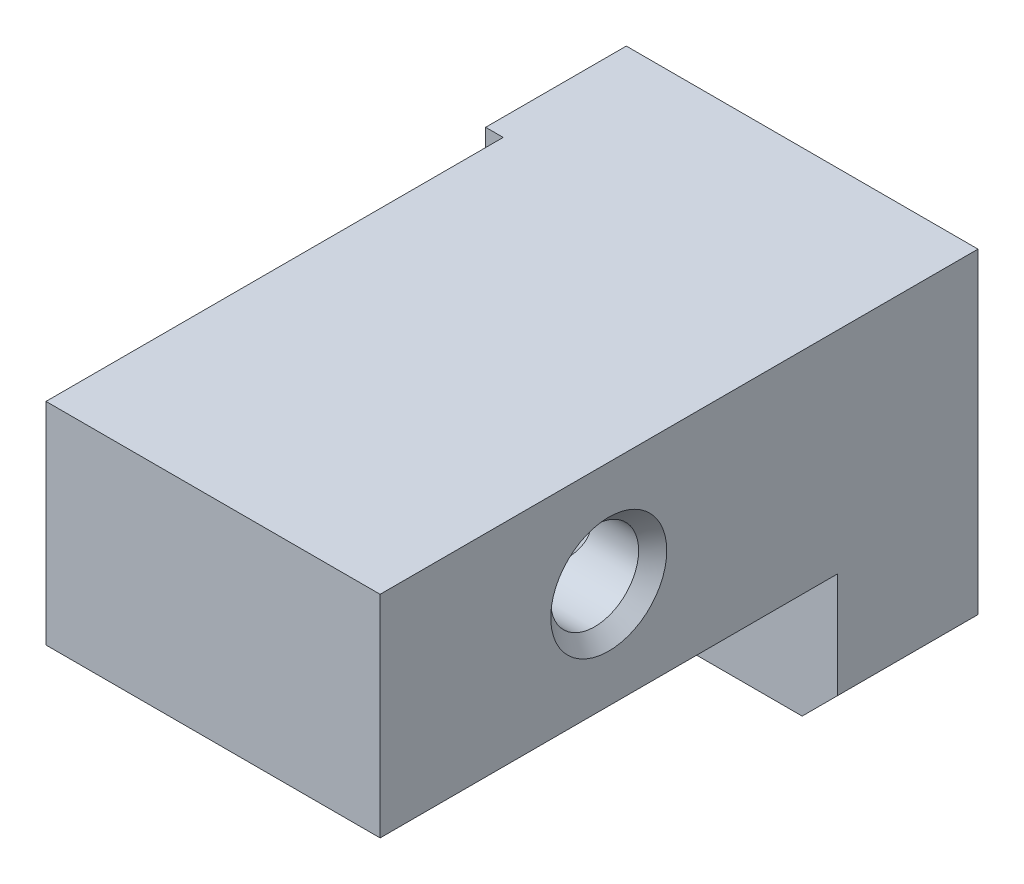
ISO-10303-21;
HEADER;
FILE_DESCRIPTION(('STEP AP214'),'2;1');
FILE_NAME('part.step','',(''),(''),'','','');
FILE_SCHEMA(('AUTOMOTIVE_DESIGN { 1 0 10303 214 1 1 1 1 }'));
ENDSEC;
DATA;
#1=APPLICATION_CONTEXT('core data for automotive mechanical design processes');
#2=APPLICATION_PROTOCOL_DEFINITION('international standard','automotive_design',2000,#1);
#3=PRODUCT_CONTEXT('',#1,'mechanical');
#4=PRODUCT('Part','Part','',(#3));
#5=PRODUCT_RELATED_PRODUCT_CATEGORY('part','',(#4));
#6=PRODUCT_DEFINITION_FORMATION('','',#4);
#7=PRODUCT_DEFINITION_CONTEXT('part definition',#1,'design');
#8=PRODUCT_DEFINITION('design','',#6,#7);
#9=PRODUCT_DEFINITION_SHAPE('','',#8);
#10=(LENGTH_UNIT() NAMED_UNIT(*) SI_UNIT(.MILLI.,.METRE.));
#11=(NAMED_UNIT(*) PLANE_ANGLE_UNIT() SI_UNIT($,.RADIAN.));
#12=(NAMED_UNIT(*) SI_UNIT($,.STERADIAN.) SOLID_ANGLE_UNIT());
#13=UNCERTAINTY_MEASURE_WITH_UNIT(LENGTH_MEASURE(1.E-05),#10,'distance_accuracy_value','');
#14=(GEOMETRIC_REPRESENTATION_CONTEXT(3) GLOBAL_UNCERTAINTY_ASSIGNED_CONTEXT((#13)) GLOBAL_UNIT_ASSIGNED_CONTEXT((#10,
#11,#12)) REPRESENTATION_CONTEXT('',''));
#15=CARTESIAN_POINT('',(0.,0.,0.));
#16=DIRECTION('',(0.,0.,1.));
#17=DIRECTION('',(1.,0.,0.));
#18=AXIS2_PLACEMENT_3D('',#15,#16,#17);
#19=CARTESIAN_POINT('',(10.,0.,17.));
#20=DIRECTION('',(-1.,0.,0.));
#21=DIRECTION('',(0.,0.,1.));
#22=AXIS2_PLACEMENT_3D('',#19,#20,#21);
#23=PLANE('',#22);
#24=CARTESIAN_POINT('',(10.,7.,10.5));
#25=DIRECTION('',(1.,0.,0.));
#26=DIRECTION('',(0.,0.,-1.));
#27=AXIS2_PLACEMENT_3D('',#24,#25,#26);
#28=CIRCLE('',#27,1.65);
#29=CARTESIAN_POINT('',(10.,7.,8.85));
#30=VERTEX_POINT('',#29);
#31=EDGE_CURVE('E259',#30,#30,#28,.T.);
#32=ORIENTED_EDGE('',*,*,#31,.F.);
#33=EDGE_LOOP('',(#32));
#34=FACE_BOUND('',#33,.T.);
#35=DIRECTION('',(0.,1.,0.));
#36=VECTOR('',#35,1.);
#37=CARTESIAN_POINT('',(10.,-6.14142135623731,4.));
#38=LINE('',#37,#36);
#39=CARTESIAN_POINT('',(10.,0.999999999999999,4.));
#40=VERTEX_POINT('',#39);
#41=CARTESIAN_POINT('',(10.,4.,3.99999999999999));
#42=VERTEX_POINT('',#41);
#43=EDGE_CURVE('E152',#40,#42,#38,.T.);
#44=ORIENTED_EDGE('',*,*,#43,.F.);
#45=DIRECTION('',(0.,0.,-1.));
#46=VECTOR('',#45,1.);
#47=CARTESIAN_POINT('',(10.,1.,17.));
#48=LINE('',#47,#46);
#49=CARTESIAN_POINT('',(10.,1.,0.));
#50=VERTEX_POINT('',#49);
#51=EDGE_CURVE('E139',#40,#50,#48,.T.);
#52=ORIENTED_EDGE('',*,*,#51,.T.);
#53=DIRECTION('',(0.,1.,0.));
#54=VECTOR('',#53,1.);
#55=CARTESIAN_POINT('',(10.,0.,0.));
#56=LINE('',#55,#54);
#57=CARTESIAN_POINT('',(10.,10.,0.));
#58=VERTEX_POINT('',#57);
#59=EDGE_CURVE('E149',#50,#58,#56,.T.);
#60=ORIENTED_EDGE('',*,*,#59,.T.);
#61=DIRECTION('',(0.,0.,-1.));
#62=VECTOR('',#61,1.);
#63=CARTESIAN_POINT('',(10.,10.,17.));
#64=LINE('',#63,#62);
#65=CARTESIAN_POINT('',(10.,10.,17.));
#66=VERTEX_POINT('',#65);
#67=EDGE_CURVE('E170',#66,#58,#64,.T.);
#68=ORIENTED_EDGE('',*,*,#67,.F.);
#69=DIRECTION('',(0.,1.,0.));
#70=VECTOR('',#69,1.);
#71=CARTESIAN_POINT('',(10.,0.,17.));
#72=LINE('',#71,#70);
#73=CARTESIAN_POINT('',(10.,4.,17.));
#74=VERTEX_POINT('',#73);
#75=EDGE_CURVE('E162',#74,#66,#72,.T.);
#76=ORIENTED_EDGE('',*,*,#75,.F.);
#77=DIRECTION('',(0.,0.,1.));
#78=VECTOR('',#77,1.);
#79=CARTESIAN_POINT('',(10.,4.,-14.142135623731));
#80=LINE('',#79,#78);
#81=EDGE_CURVE('E241',#42,#74,#80,.T.);
#82=ORIENTED_EDGE('',*,*,#81,.F.);
#83=EDGE_LOOP('',(#44,#52,#60,#68,#76,#82));
#84=FACE_BOUND('',#83,.T.);
#85=ADVANCED_FACE('F32',(#34,#84),#23,.F.);
#86=CARTESIAN_POINT('',(0.,10.,17.));
#87=DIRECTION('',(0.,-1.,0.));
#88=DIRECTION('',(0.,0.,-1.));
#89=AXIS2_PLACEMENT_3D('',#86,#87,#88);
#90=PLANE('',#89);
#91=DIRECTION('',(0.,0.,1.));
#92=VECTOR('',#91,1.);
#93=CARTESIAN_POINT('',(0.5,10.,-14.142135623731));
#94=LINE('',#93,#92);
#95=CARTESIAN_POINT('',(0.5,10.,3.99999999999999));
#96=VERTEX_POINT('',#95);
#97=CARTESIAN_POINT('',(0.5,10.,17.));
#98=VERTEX_POINT('',#97);
#99=EDGE_CURVE('E236',#96,#98,#94,.T.);
#100=ORIENTED_EDGE('',*,*,#99,.T.);
#101=DIRECTION('',(-1.,0.,0.));
#102=VECTOR('',#101,1.);
#103=CARTESIAN_POINT('',(0.,10.,17.));
#104=LINE('',#103,#102);
#105=EDGE_CURVE('E171',#66,#98,#104,.T.);
#106=ORIENTED_EDGE('',*,*,#105,.F.);
#107=ORIENTED_EDGE('',*,*,#67,.T.);
#108=DIRECTION('',(-1.,0.,0.));
#109=VECTOR('',#108,1.);
#110=CARTESIAN_POINT('',(0.,10.,0.));
#111=LINE('',#110,#109);
#112=CARTESIAN_POINT('',(0.,10.,0.));
#113=VERTEX_POINT('',#112);
#114=EDGE_CURVE('E159',#58,#113,#111,.T.);
#115=ORIENTED_EDGE('',*,*,#114,.T.);
#116=DIRECTION('',(0.,0.,-1.));
#117=VECTOR('',#116,1.);
#118=CARTESIAN_POINT('',(0.,10.,17.));
#119=LINE('',#118,#117);
#120=CARTESIAN_POINT('',(0.,10.,3.99999999999999));
#121=VERTEX_POINT('',#120);
#122=EDGE_CURVE('E168',#121,#113,#119,.T.);
#123=ORIENTED_EDGE('',*,*,#122,.F.);
#124=DIRECTION('',(-1.,0.,0.));
#125=VECTOR('',#124,1.);
#126=CARTESIAN_POINT('',(5.,10.,4.));
#127=LINE('',#126,#125);
#128=EDGE_CURVE('E240',#96,#121,#127,.T.);
#129=ORIENTED_EDGE('',*,*,#128,.F.);
#130=EDGE_LOOP('',(#100,#106,#107,#115,#123,#129));
#131=FACE_BOUND('',#130,.T.);
#132=ADVANCED_FACE('F202',(#131),#90,.F.);
#133=CARTESIAN_POINT('',(0.,10.,17.));
#134=DIRECTION('',(0.,0.,-1.));
#135=DIRECTION('',(-1.,0.,0.));
#136=AXIS2_PLACEMENT_3D('',#133,#134,#135);
#137=PLANE('',#136);
#138=DIRECTION('',(1.,0.,0.));
#139=VECTOR('',#138,1.);
#140=CARTESIAN_POINT('',(5.,4.,17.));
#141=LINE('',#140,#139);
#142=CARTESIAN_POINT('',(0.5,4.,17.));
#143=VERTEX_POINT('',#142);
#144=EDGE_CURVE('E234',#143,#74,#141,.T.);
#145=ORIENTED_EDGE('',*,*,#144,.T.);
#146=ORIENTED_EDGE('',*,*,#75,.T.);
#147=ORIENTED_EDGE('',*,*,#105,.T.);
#148=DIRECTION('',(0.,-1.,0.));
#149=VECTOR('',#148,1.);
#150=CARTESIAN_POINT('',(0.500000000000001,-6.14142135623731,17.));
#151=LINE('',#150,#149);
#152=EDGE_CURVE('E239',#98,#143,#151,.T.);
#153=ORIENTED_EDGE('',*,*,#152,.T.);
#154=EDGE_LOOP('',(#145,#146,#147,#153));
#155=FACE_BOUND('',#154,.T.);
#156=ADVANCED_FACE('F198',(#155),#137,.F.);
#157=CARTESIAN_POINT('',(0.,0.,17.));
#158=DIRECTION('',(1.,0.,0.));
#159=DIRECTION('',(0.,0.,-1.));
#160=AXIS2_PLACEMENT_3D('',#157,#158,#159);
#161=PLANE('',#160);
#162=DIRECTION('',(0.,0.,-1.));
#163=VECTOR('',#162,1.);
#164=CARTESIAN_POINT('',(0.,0.,17.));
#165=LINE('',#164,#163);
#166=CARTESIAN_POINT('',(0.,0.,3.99999999999999));
#167=VERTEX_POINT('',#166);
#168=CARTESIAN_POINT('',(0.,0.,0.));
#169=VERTEX_POINT('',#168);
#170=EDGE_CURVE('E173',#167,#169,#165,.T.);
#171=ORIENTED_EDGE('',*,*,#170,.F.);
#172=DIRECTION('',(0.,-1.,0.));
#173=VECTOR('',#172,1.);
#174=CARTESIAN_POINT('',(0.,-6.14142135623731,4.));
#175=LINE('',#174,#173);
#176=EDGE_CURVE('E222',#121,#167,#175,.T.);
#177=ORIENTED_EDGE('',*,*,#176,.F.);
#178=ORIENTED_EDGE('',*,*,#122,.T.);
#179=DIRECTION('',(0.,-1.,0.));
#180=VECTOR('',#179,1.);
#181=CARTESIAN_POINT('',(0.,0.,0.));
#182=LINE('',#181,#180);
#183=EDGE_CURVE('E164',#113,#169,#182,.T.);
#184=ORIENTED_EDGE('',*,*,#183,.T.);
#185=EDGE_LOOP('',(#171,#177,#178,#184));
#186=FACE_BOUND('',#185,.T.);
#187=ADVANCED_FACE('F201',(#186),#161,.F.);
#188=CARTESIAN_POINT('',(0.,0.,17.));
#189=DIRECTION('',(0.,1.,0.));
#190=DIRECTION('',(0.,0.,1.));
#191=AXIS2_PLACEMENT_3D('',#188,#189,#190);
#192=PLANE('',#191);
#193=DIRECTION('',(1.,0.,0.));
#194=VECTOR('',#193,1.);
#195=CARTESIAN_POINT('',(0.,0.,0.));
#196=LINE('',#195,#194);
#197=CARTESIAN_POINT('',(9.,0.,0.));
#198=VERTEX_POINT('',#197);
#199=EDGE_CURVE('E160',#169,#198,#196,.T.);
#200=ORIENTED_EDGE('',*,*,#199,.T.);
#201=DIRECTION('',(0.,0.,1.));
#202=VECTOR('',#201,1.);
#203=CARTESIAN_POINT('',(9.,0.,17.));
#204=LINE('',#203,#202);
#205=CARTESIAN_POINT('',(9.,0.,4.));
#206=VERTEX_POINT('',#205);
#207=EDGE_CURVE('E40',#198,#206,#204,.T.);
#208=ORIENTED_EDGE('',*,*,#207,.T.);
#209=DIRECTION('',(1.,0.,0.));
#210=VECTOR('',#209,1.);
#211=CARTESIAN_POINT('',(5.,0.,4.));
#212=LINE('',#211,#210);
#213=EDGE_CURVE('E224',#167,#206,#212,.T.);
#214=ORIENTED_EDGE('',*,*,#213,.F.);
#215=ORIENTED_EDGE('',*,*,#170,.T.);
#216=EDGE_LOOP('',(#200,#208,#214,#215));
#217=FACE_BOUND('',#216,.T.);
#218=ADVANCED_FACE('F206',(#217),#192,.F.);
#219=CARTESIAN_POINT('',(0.,10.,0.));
#220=DIRECTION('',(0.,0.,-1.));
#221=DIRECTION('',(-1.,0.,0.));
#222=AXIS2_PLACEMENT_3D('',#219,#220,#221);
#223=PLANE('',#222);
#224=CARTESIAN_POINT('',(3.,3.,0.));
#225=DIRECTION('',(0.,0.,-1.));
#226=DIRECTION('',(-1.,0.,0.));
#227=AXIS2_PLACEMENT_3D('',#224,#225,#226);
#228=CIRCLE('',#227,1.65);
#229=CARTESIAN_POINT('',(1.35,3.,0.));
#230=VERTEX_POINT('',#229);
#231=EDGE_CURVE('E272',#230,#230,#228,.T.);
#232=ORIENTED_EDGE('',*,*,#231,.F.);
#233=EDGE_LOOP('',(#232));
#234=FACE_BOUND('',#233,.T.);
#235=CARTESIAN_POINT('',(7.,7.,0.));
#236=DIRECTION('',(0.,0.,-1.));
#237=DIRECTION('',(-1.,0.,0.));
#238=AXIS2_PLACEMENT_3D('',#235,#236,#237);
#239=CIRCLE('',#238,1.65);
#240=CARTESIAN_POINT('',(5.35,7.,0.));
#241=VERTEX_POINT('',#240);
#242=EDGE_CURVE('E130',#241,#241,#239,.T.);
#243=ORIENTED_EDGE('',*,*,#242,.F.);
#244=EDGE_LOOP('',(#243));
#245=FACE_BOUND('',#244,.T.);
#246=ORIENTED_EDGE('',*,*,#59,.F.);
#247=DIRECTION('',(0.707106781186548,0.707106781186548,0.));
#248=VECTOR('',#247,1.);
#249=CARTESIAN_POINT('',(9.5,0.5,0.));
#250=LINE('',#249,#248);
#251=EDGE_CURVE('E54',#50,#198,#250,.F.);
#252=ORIENTED_EDGE('',*,*,#251,.T.);
#253=ORIENTED_EDGE('',*,*,#199,.F.);
#254=ORIENTED_EDGE('',*,*,#183,.F.);
#255=ORIENTED_EDGE('',*,*,#114,.F.);
#256=EDGE_LOOP('',(#246,#252,#253,#254,#255));
#257=FACE_BOUND('',#256,.T.);
#258=ADVANCED_FACE('F156',(#234,#245,#257),#223,.T.);
#259=CARTESIAN_POINT('',(5.,4.,-14.142135623731));
#260=DIRECTION('',(0.,-1.,0.));
#261=DIRECTION('',(0.,0.,-1.));
#262=AXIS2_PLACEMENT_3D('',#259,#260,#261);
#263=PLANE('',#262);
#264=DIRECTION('',(0.,0.,-1.));
#265=VECTOR('',#264,1.);
#266=CARTESIAN_POINT('',(2.25000000000001,4.,0.));
#267=LINE('',#266,#265);
#268=CARTESIAN_POINT('',(2.25000000000001,4.,10.5));
#269=VERTEX_POINT('',#268);
#270=CARTESIAN_POINT('',(2.25000000000001,4.,4.));
#271=VERTEX_POINT('',#270);
#272=EDGE_CURVE('E128',#269,#271,#267,.T.);
#273=ORIENTED_EDGE('',*,*,#272,.F.);
#274=CARTESIAN_POINT('',(-3.28218000554504,4.,7.4288377454002));
#275=CARTESIAN_POINT('',(-3.09777998347761,4.,7.53825342951428));
#276=CARTESIAN_POINT('',(-2.91333225664367,4.,7.64758884214047));
#277=CARTESIAN_POINT('',(-2.54419581752837,4.,7.86608745976319));
#278=CARTESIAN_POINT('',(-2.35950702820203,4.,7.97525053457879));
#279=CARTESIAN_POINT('',(-1.98799833152211,4.,8.19442108739972));
#280=CARTESIAN_POINT('',(-1.80117650569774,4.,8.30442531671342));
#281=CARTESIAN_POINT('',(-1.42737594060246,4.,8.52392885567407));
#282=CARTESIAN_POINT('',(-1.24039734572488,4.,8.63342841141565));
#283=CARTESIAN_POINT('',(-0.780083504389306,4.,8.90197867049217));
#284=CARTESIAN_POINT('',(-0.506543444435075,4.,9.06067993979783));
#285=CARTESIAN_POINT('',(-0.0948605934279703,4.,9.29697933161514));
#286=CARTESIAN_POINT('',(0.0427341616270211,4.,9.37553141656494));
#287=CARTESIAN_POINT('',(0.318437865147274,4.,9.53166643161495));
#288=CARTESIAN_POINT('',(0.456546705423733,4.,9.60924955215087));
#289=CARTESIAN_POINT('',(0.732412619966914,4.,9.76230214337178));
#290=CARTESIAN_POINT('',(0.870162864007639,4.,9.83778391090105));
#291=CARTESIAN_POINT('',(1.14703711691595,4.,9.98647699693115));
#292=CARTESIAN_POINT('',(1.28616211300629,4.,10.0596864996025));
#293=CARTESIAN_POINT('',(1.49621185924996,4.,10.1661923965841));
#294=CARTESIAN_POINT('',(1.56632608528861,4.,10.2010821959868));
#295=CARTESIAN_POINT('',(1.7072733699935,4.,10.2693730994472));
#296=CARTESIAN_POINT('',(1.77810636432124,4.,10.3027743353312));
#297=CARTESIAN_POINT('',(1.92064687192913,4.,10.3674186452816));
#298=CARTESIAN_POINT('',(1.99235315424808,4.,10.3986644182814));
#299=CARTESIAN_POINT('',(2.13703228570798,4.,10.4580504455995));
#300=CARTESIAN_POINT('',(2.2100045220709,4.,10.486192156418));
#301=CARTESIAN_POINT('',(2.31054073645686,4.,10.5213611292535));
#302=CARTESIAN_POINT('',(2.33739773685517,4.,10.530412390722));
#303=CARTESIAN_POINT('',(2.3913471388421,4.,10.5478022244002));
#304=CARTESIAN_POINT('',(2.41843957607207,4.,10.5561406865577));
#305=CARTESIAN_POINT('',(2.47285780807749,4.,10.5719933754939));
#306=CARTESIAN_POINT('',(2.50018353348571,4.,10.5795078386746));
#307=CARTESIAN_POINT('',(2.55507526148118,4.,10.5935954422289));
#308=CARTESIAN_POINT('',(2.58264126184341,4.,10.6001685913095));
#309=CARTESIAN_POINT('',(2.66412214424739,4.,10.6179425340213));
#310=CARTESIAN_POINT('',(2.71837486063787,4.,10.6276632050761));
#311=CARTESIAN_POINT('',(2.82755475912009,4.,10.6421848956395));
#312=CARTESIAN_POINT('',(2.88248200327228,4.,10.6469854589855));
#313=CARTESIAN_POINT('',(3.00028930768957,4.,10.6513906221917));
#314=CARTESIAN_POINT('',(3.06320319536373,4.,10.6501710676137));
#315=CARTESIAN_POINT('',(3.18848577460418,4.,10.6407808916559));
#316=CARTESIAN_POINT('',(3.25085441477162,4.,10.6326096219469));
#317=CARTESIAN_POINT('',(3.37624049737647,4.,10.6101339812577));
#318=CARTESIAN_POINT('',(3.43922740580151,4.,10.5956646825874));
#319=CARTESIAN_POINT('',(3.53274597642482,4.,10.5704725535371));
#320=CARTESIAN_POINT('',(3.56376800212645,4.,10.5614904879239));
#321=CARTESIAN_POINT('',(3.62550519940147,4.,10.5425304749236));
#322=CARTESIAN_POINT('',(3.65622038963362,4.,10.5325525885032));
#323=CARTESIAN_POINT('',(3.74556580819081,4.,10.5021627950095));
#324=CARTESIAN_POINT('',(3.80380943440734,4.,10.4806165828116));
#325=CARTESIAN_POINT('',(3.9194190655351,4.,10.4352724368601));
#326=CARTESIAN_POINT('',(3.97678479868116,4.,10.4114738215905));
#327=CARTESIAN_POINT('',(4.09085673324565,4.,10.3622092815781));
#328=CARTESIAN_POINT('',(4.14756225123471,4.,10.3367417836081));
#329=CARTESIAN_POINT('',(4.2604078820774,4.,10.2845797181693));
#330=CARTESIAN_POINT('',(4.31654795111435,4.,10.2578850564857));
#331=CARTESIAN_POINT('',(4.4847142897053,4.,10.1762294858143));
#332=CARTESIAN_POINT('',(4.59606655771137,4.,10.1198842494594));
#333=CARTESIAN_POINT('',(4.81756074648985,4.,10.0050413012534));
#334=CARTESIAN_POINT('',(4.92770332234753,4.,9.94654483741467));
#335=CARTESIAN_POINT('',(5.13284235231132,4.,9.83589166408657));
#336=CARTESIAN_POINT('',(5.22793258291671,4.,9.78390844137565));
#337=CARTESIAN_POINT('',(5.41770801042315,4.,9.67917250830241));
#338=CARTESIAN_POINT('',(5.512393137204,4.,9.62641967118235));
#339=CARTESIAN_POINT('',(5.7007247694621,4.,9.52076602136484));
#340=CARTESIAN_POINT('',(5.79437366450722,4.,9.46786946187677));
#341=CARTESIAN_POINT('',(5.98141428078242,4.,9.36166555839571));
#342=CARTESIAN_POINT('',(6.07480604847641,4.,9.30835829627476));
#343=CARTESIAN_POINT('',(6.16811252428892,4.,9.25490348658434));
#344=B_SPLINE_CURVE_WITH_KNOTS('',3,(#274,#275,#276,#277,#278,#279,#280,#281,#282,#283,#284,
#285,#286,#287,#288,#289,#290,#291,#292,#293,#294,#295,#296,#297,#298,#299,#300,#301,#302,#303,
#304,#305,#306,#307,#308,#309,#310,#311,#312,#313,#314,#315,#316,#317,#318,#319,#320,#321,#322,
#323,#324,#325,#326,#327,#328,#329,#330,#331,#332,#333,#334,#335,#336,#337,#338,#339,#340,#341,
#342,#343),.UNSPECIFIED.,.F.,.F.,(4,2,2,2,2,2,2,2,2,2,2,2,2,2,2,2,2,2,2,2,2,2,2,2,2,2,2,2,2,2,2,
2,2,2,4),(0.,0.643254625037693,1.28686828666142,1.93727516913786,2.58732150342344,
3.53604405472525,4.01135733006806,4.48657567107947,4.95779251087112,5.42937669383638,
5.66431146481985,5.89922538860252,6.13383961866136,6.36834328955212,6.45335889870211,
6.53838761017753,6.6233918630661,6.7083953296298,6.87354420947743,7.03870839954669,
7.22706193699917,7.41543304256008,7.60906550095371,7.70594181167481,7.80281219501478,
7.98904350546291,8.17533134571083,8.36179739541616,8.54827778491051,8.92261768343395,
9.29674373627406,9.62185358211963,9.9470175929639,10.2696825571687,10.5922847829639),.UNSPECIFIED.);
#345=CARTESIAN_POINT('',(3.74999999999999,4.,10.5));
#346=VERTEX_POINT('',#345);
#347=EDGE_CURVE('E114',#346,#269,#344,.F.);
#348=ORIENTED_EDGE('',*,*,#347,.F.);
#349=DIRECTION('',(0.,0.,-1.));
#350=VECTOR('',#349,1.);
#351=CARTESIAN_POINT('',(3.74999999999999,4.,0.));
#352=LINE('',#351,#350);
#353=CARTESIAN_POINT('',(3.74999999999999,4.,4.));
#354=VERTEX_POINT('',#353);
#355=EDGE_CURVE('E122',#354,#346,#352,.F.);
#356=ORIENTED_EDGE('',*,*,#355,.F.);
#357=DIRECTION('',(1.,0.,0.));
#358=VECTOR('',#357,1.);
#359=CARTESIAN_POINT('',(5.,4.,4.));
#360=LINE('',#359,#358);
#361=EDGE_CURVE('E225',#354,#42,#360,.T.);
#362=ORIENTED_EDGE('',*,*,#361,.T.);
#363=ORIENTED_EDGE('',*,*,#81,.T.);
#364=ORIENTED_EDGE('',*,*,#144,.F.);
#365=DIRECTION('',(0.,0.,1.));
#366=VECTOR('',#365,1.);
#367=CARTESIAN_POINT('',(0.5,4.,-14.142135623731));
#368=LINE('',#367,#366);
#369=CARTESIAN_POINT('',(0.5,4.,4.));
#370=VERTEX_POINT('',#369);
#371=EDGE_CURVE('E231',#370,#143,#368,.T.);
#372=ORIENTED_EDGE('',*,*,#371,.F.);
#373=EDGE_CURVE('E136',#370,#271,#360,.T.);
#374=ORIENTED_EDGE('',*,*,#373,.T.);
#375=EDGE_LOOP('',(#273,#348,#356,#362,#363,#364,#372,#374));
#376=FACE_BOUND('',#375,.T.);
#377=ADVANCED_FACE('F134',(#376),#263,.T.);
#378=CARTESIAN_POINT('',(0.500000000000001,-6.14142135623731,-14.142135623731));
#379=DIRECTION('',(-1.,0.,0.));
#380=DIRECTION('',(0.,-1.,0.));
#381=AXIS2_PLACEMENT_3D('',#378,#379,#380);
#382=PLANE('',#381);
#383=CARTESIAN_POINT('',(0.499999999999997,7.,10.5));
#384=DIRECTION('',(1.,0.,0.));
#385=DIRECTION('',(0.,0.,-1.));
#386=AXIS2_PLACEMENT_3D('',#383,#384,#385);
#387=CIRCLE('',#386,1.65);
#388=CARTESIAN_POINT('',(0.499999999999997,7.,8.85));
#389=VERTEX_POINT('',#388);
#390=EDGE_CURVE('E262',#389,#389,#387,.T.);
#391=ORIENTED_EDGE('',*,*,#390,.T.);
#392=EDGE_LOOP('',(#391));
#393=FACE_BOUND('',#392,.T.);
#394=DIRECTION('',(0.,-1.,0.));
#395=VECTOR('',#394,1.);
#396=CARTESIAN_POINT('',(0.500000000000001,-6.14142135623731,4.));
#397=LINE('',#396,#395);
#398=EDGE_CURVE('E243',#96,#370,#397,.T.);
#399=ORIENTED_EDGE('',*,*,#398,.T.);
#400=ORIENTED_EDGE('',*,*,#371,.T.);
#401=ORIENTED_EDGE('',*,*,#152,.F.);
#402=ORIENTED_EDGE('',*,*,#99,.F.);
#403=EDGE_LOOP('',(#399,#400,#401,#402));
#404=FACE_BOUND('',#403,.T.);
#405=ADVANCED_FACE('F191',(#393,#404),#382,.T.);
#406=CARTESIAN_POINT('',(0.,10.,4.));
#407=DIRECTION('',(0.,0.,-1.));
#408=DIRECTION('',(-1.,0.,0.));
#409=AXIS2_PLACEMENT_3D('',#406,#407,#408);
#410=PLANE('',#409);
#411=ORIENTED_EDGE('',*,*,#213,.T.);
#412=DIRECTION('',(-0.707106781186548,-0.707106781186548,0.));
#413=VECTOR('',#412,1.);
#414=CARTESIAN_POINT('',(10.,1.,4.));
#415=LINE('',#414,#413);
#416=EDGE_CURVE('E12',#206,#40,#415,.F.);
#417=ORIENTED_EDGE('',*,*,#416,.T.);
#418=ORIENTED_EDGE('',*,*,#43,.T.);
#419=ORIENTED_EDGE('',*,*,#361,.F.);
#420=CARTESIAN_POINT('',(3.,3.,4.));
#421=DIRECTION('',(0.,0.,-1.));
#422=DIRECTION('',(-1.,0.,0.));
#423=AXIS2_PLACEMENT_3D('',#420,#421,#422);
#424=CIRCLE('',#423,1.25);
#425=EDGE_CURVE('E137',#354,#271,#424,.T.);
#426=ORIENTED_EDGE('',*,*,#425,.T.);
#427=ORIENTED_EDGE('',*,*,#373,.F.);
#428=ORIENTED_EDGE('',*,*,#398,.F.);
#429=ORIENTED_EDGE('',*,*,#128,.T.);
#430=ORIENTED_EDGE('',*,*,#176,.T.);
#431=EDGE_LOOP('',(#411,#417,#418,#419,#426,#427,#428,#429,#430));
#432=FACE_BOUND('',#431,.T.);
#433=ADVANCED_FACE('F193',(#432),#410,.F.);
#434=CARTESIAN_POINT('',(0.899999999999998,7.,10.5));
#435=DIRECTION('',(-1.,0.,0.));
#436=DIRECTION('',(0.,0.,1.));
#437=AXIS2_PLACEMENT_3D('',#434,#435,#436);
#438=CONICAL_SURFACE('',#437,1.25,0.785398163397446);
#439=ORIENTED_EDGE('',*,*,#390,.F.);
#440=EDGE_LOOP('',(#439));
#441=FACE_BOUND('',#440,.T.);
#442=CARTESIAN_POINT('',(0.899999999999998,7.,10.5));
#443=DIRECTION('',(1.,0.,0.));
#444=DIRECTION('',(0.,0.,-1.));
#445=AXIS2_PLACEMENT_3D('',#442,#443,#444);
#446=CIRCLE('',#445,1.25);
#447=CARTESIAN_POINT('',(0.899999999999998,7.,9.25));
#448=VERTEX_POINT('',#447);
#449=EDGE_CURVE('E235',#448,#448,#446,.T.);
#450=ORIENTED_EDGE('',*,*,#449,.T.);
#451=EDGE_LOOP('',(#450));
#452=FACE_BOUND('',#451,.T.);
#453=ADVANCED_FACE('F196',(#441,#452),#438,.F.);
#454=CARTESIAN_POINT('',(10.,7.,10.5));
#455=DIRECTION('',(1.,0.,0.));
#456=DIRECTION('',(0.,0.,-1.));
#457=AXIS2_PLACEMENT_3D('',#454,#455,#456);
#458=CYLINDRICAL_SURFACE('',#457,1.25);
#459=CARTESIAN_POINT('',(7.,7.,10.5));
#460=DIRECTION('',(0.707106781186547,0.,0.707106781186547));
#461=DIRECTION('',(0.707106781186547,0.,-0.707106781186547));
#462=AXIS2_PLACEMENT_3D('',#459,#460,#461);
#463=ELLIPSE('',#462,1.76776695296637,1.25);
#464=CARTESIAN_POINT('',(7.,8.25,10.5));
#465=VERTEX_POINT('',#464);
#466=CARTESIAN_POINT('',(7.,5.75,10.5));
#467=VERTEX_POINT('',#466);
#468=EDGE_CURVE('E175',#465,#467,#463,.F.);
#469=ORIENTED_EDGE('',*,*,#468,.T.);
#470=CARTESIAN_POINT('',(7.,7.,10.5));
#471=DIRECTION('',(0.707106781186547,0.,-0.707106781186547));
#472=DIRECTION('',(0.707106781186547,0.,0.707106781186547));
#473=AXIS2_PLACEMENT_3D('',#470,#471,#472);
#474=ELLIPSE('',#473,1.76776695296637,1.25);
#475=EDGE_CURVE('E123',#467,#465,#474,.T.);
#476=ORIENTED_EDGE('',*,*,#475,.T.);
#477=EDGE_LOOP('',(#469,#476));
#478=FACE_BOUND('',#477,.T.);
#479=ORIENTED_EDGE('',*,*,#449,.F.);
#480=EDGE_LOOP('',(#479));
#481=FACE_BOUND('',#480,.T.);
#482=CARTESIAN_POINT('',(9.6,7.,10.5));
#483=DIRECTION('',(1.,0.,0.));
#484=DIRECTION('',(0.,0.,-1.));
#485=AXIS2_PLACEMENT_3D('',#482,#483,#484);
#486=CIRCLE('',#485,1.25);
#487=CARTESIAN_POINT('',(9.6,7.,9.25));
#488=VERTEX_POINT('',#487);
#489=EDGE_CURVE('E256',#488,#488,#486,.T.);
#490=ORIENTED_EDGE('',*,*,#489,.T.);
#491=EDGE_LOOP('',(#490));
#492=FACE_BOUND('',#491,.T.);
#493=ADVANCED_FACE('F295',(#478,#481,#492),#458,.F.);
#494=CARTESIAN_POINT('',(10.,7.,10.5));
#495=DIRECTION('',(1.,0.,0.));
#496=DIRECTION('',(0.,0.,-1.));
#497=AXIS2_PLACEMENT_3D('',#494,#495,#496);
#498=CONICAL_SURFACE('',#497,1.65,0.785398163397448);
#499=ORIENTED_EDGE('',*,*,#489,.F.);
#500=EDGE_LOOP('',(#499));
#501=FACE_BOUND('',#500,.T.);
#502=ORIENTED_EDGE('',*,*,#31,.T.);
#503=EDGE_LOOP('',(#502));
#504=FACE_BOUND('',#503,.T.);
#505=ADVANCED_FACE('F288',(#501,#504),#498,.F.);
#506=CARTESIAN_POINT('',(7.,7.,0.));
#507=DIRECTION('',(0.,0.,-1.));
#508=DIRECTION('',(-1.,0.,0.));
#509=AXIS2_PLACEMENT_3D('',#506,#507,#508);
#510=CYLINDRICAL_SURFACE('',#509,1.25);
#511=CARTESIAN_POINT('',(7.,7.,0.400000000000001));
#512=DIRECTION('',(0.,0.,-1.));
#513=DIRECTION('',(-1.,0.,0.));
#514=AXIS2_PLACEMENT_3D('',#511,#512,#513);
#515=CIRCLE('',#514,1.25);
#516=CARTESIAN_POINT('',(5.75,7.,0.400000000000001));
#517=VERTEX_POINT('',#516);
#518=EDGE_CURVE('E265',#517,#517,#515,.T.);
#519=ORIENTED_EDGE('',*,*,#518,.T.);
#520=EDGE_LOOP('',(#519));
#521=FACE_BOUND('',#520,.T.);
#522=ORIENTED_EDGE('',*,*,#468,.F.);
#523=ORIENTED_EDGE('',*,*,#475,.F.);
#524=EDGE_LOOP('',(#522,#523));
#525=FACE_BOUND('',#524,.T.);
#526=ADVANCED_FACE('F282',(#521,#525),#510,.F.);
#527=CARTESIAN_POINT('',(7.,7.,0.));
#528=DIRECTION('',(0.,0.,-1.));
#529=DIRECTION('',(-1.,0.,0.));
#530=AXIS2_PLACEMENT_3D('',#527,#528,#529);
#531=CONICAL_SURFACE('',#530,1.65,0.785398163397448);
#532=ORIENTED_EDGE('',*,*,#518,.F.);
#533=EDGE_LOOP('',(#532));
#534=FACE_BOUND('',#533,.T.);
#535=ORIENTED_EDGE('',*,*,#242,.T.);
#536=EDGE_LOOP('',(#535));
#537=FACE_BOUND('',#536,.T.);
#538=ADVANCED_FACE('F280',(#534,#537),#531,.F.);
#539=CARTESIAN_POINT('',(3.,3.,10.5));
#540=DIRECTION('',(0.,0.,-1.));
#541=DIRECTION('',(-1.,0.,0.));
#542=AXIS2_PLACEMENT_3D('',#539,#540,#541);
#543=CONICAL_SURFACE('',#542,1.25,1.02974425867665);
#544=ORIENTED_EDGE('',*,*,#347,.T.);
#545=CARTESIAN_POINT('',(3.,3.,10.5));
#546=DIRECTION('',(0.,0.,-1.));
#547=DIRECTION('',(-1.,0.,0.));
#548=AXIS2_PLACEMENT_3D('',#545,#546,#547);
#549=CIRCLE('',#548,1.25);
#550=EDGE_CURVE('E117',#269,#346,#549,.T.);
#551=ORIENTED_EDGE('',*,*,#550,.T.);
#552=EDGE_LOOP('',(#544,#551));
#553=FACE_BOUND('',#552,.T.);
#554=ADVANCED_FACE('F116',(#553),#543,.F.);
#555=CARTESIAN_POINT('',(3.,3.,0.));
#556=DIRECTION('',(0.,0.,-1.));
#557=DIRECTION('',(-1.,0.,0.));
#558=AXIS2_PLACEMENT_3D('',#555,#556,#557);
#559=CYLINDRICAL_SURFACE('',#558,1.25);
#560=ORIENTED_EDGE('',*,*,#272,.T.);
#561=ORIENTED_EDGE('',*,*,#425,.F.);
#562=ORIENTED_EDGE('',*,*,#355,.T.);
#563=ORIENTED_EDGE('',*,*,#550,.F.);
#564=EDGE_LOOP('',(#560,#561,#562,#563));
#565=FACE_BOUND('',#564,.T.);
#566=CARTESIAN_POINT('',(3.,3.,0.400000000000001));
#567=DIRECTION('',(0.,0.,-1.));
#568=DIRECTION('',(-1.,0.,0.));
#569=AXIS2_PLACEMENT_3D('',#566,#567,#568);
#570=CIRCLE('',#569,1.25);
#571=CARTESIAN_POINT('',(1.75,3.,0.400000000000001));
#572=VERTEX_POINT('',#571);
#573=EDGE_CURVE('E131',#572,#572,#570,.T.);
#574=ORIENTED_EDGE('',*,*,#573,.T.);
#575=EDGE_LOOP('',(#574));
#576=FACE_BOUND('',#575,.T.);
#577=ADVANCED_FACE('F126',(#565,#576),#559,.F.);
#578=CARTESIAN_POINT('',(3.,3.,0.));
#579=DIRECTION('',(0.,0.,-1.));
#580=DIRECTION('',(-1.,0.,0.));
#581=AXIS2_PLACEMENT_3D('',#578,#579,#580);
#582=CONICAL_SURFACE('',#581,1.65,0.785398163397447);
#583=ORIENTED_EDGE('',*,*,#573,.F.);
#584=EDGE_LOOP('',(#583));
#585=FACE_BOUND('',#584,.T.);
#586=ORIENTED_EDGE('',*,*,#231,.T.);
#587=EDGE_LOOP('',(#586));
#588=FACE_BOUND('',#587,.T.);
#589=ADVANCED_FACE('F276',(#585,#588),#582,.F.);
#590=CARTESIAN_POINT('',(10.,1.,17.));
#591=DIRECTION('',(-0.707106781186547,0.707106781186547,0.));
#592=DIRECTION('',(-0.707106781186548,-0.707106781186548,0.));
#593=AXIS2_PLACEMENT_3D('',#590,#591,#592);
#594=PLANE('',#593);
#595=ORIENTED_EDGE('',*,*,#416,.F.);
#596=ORIENTED_EDGE('',*,*,#207,.F.);
#597=ORIENTED_EDGE('',*,*,#251,.F.);
#598=ORIENTED_EDGE('',*,*,#51,.F.);
#599=EDGE_LOOP('',(#595,#596,#597,#598));
#600=FACE_BOUND('',#599,.T.);
#601=ADVANCED_FACE('F34',(#600),#594,.F.);
#602=CLOSED_SHELL('',(#85,#132,#156,#187,#218,#258,#377,#405,#433,#453,#493,#505,#526,#538,#554,
#577,#589,#601));
#603=MANIFOLD_SOLID_BREP('B2',#602);
#604=ADVANCED_BREP_SHAPE_REPRESENTATION('',(#18,#603),#14);
#605=SHAPE_DEFINITION_REPRESENTATION(#9,#604);
ENDSEC;
END-ISO-10303-21;
